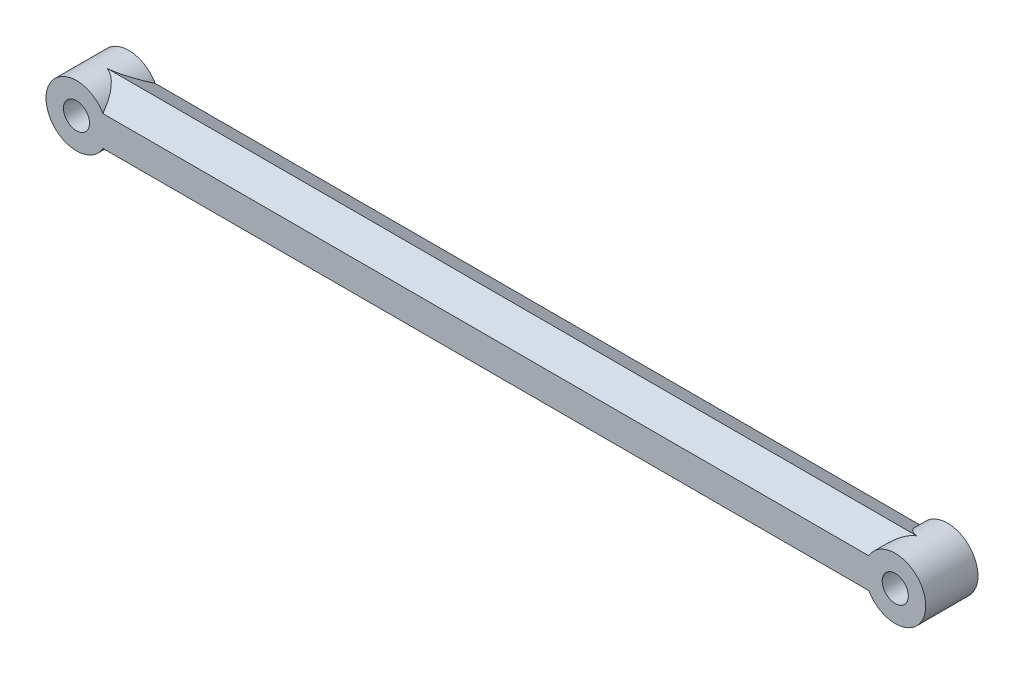
ISO-10303-21;
HEADER;
FILE_DESCRIPTION(('STEP AP214'),'2;1');
FILE_NAME('part.step','',(''),(''),'','','');
FILE_SCHEMA(('AUTOMOTIVE_DESIGN { 1 0 10303 214 1 1 1 1 }'));
ENDSEC;
DATA;
#1=APPLICATION_CONTEXT('core data for automotive mechanical design processes');
#2=APPLICATION_PROTOCOL_DEFINITION('international standard','automotive_design',2000,#1);
#3=PRODUCT_CONTEXT('',#1,'mechanical');
#4=PRODUCT('Part','Part','',(#3));
#5=PRODUCT_RELATED_PRODUCT_CATEGORY('part','',(#4));
#6=PRODUCT_DEFINITION_FORMATION('','',#4);
#7=PRODUCT_DEFINITION_CONTEXT('part definition',#1,'design');
#8=PRODUCT_DEFINITION('design','',#6,#7);
#9=PRODUCT_DEFINITION_SHAPE('','',#8);
#10=(LENGTH_UNIT() NAMED_UNIT(*) SI_UNIT(.MILLI.,.METRE.));
#11=(NAMED_UNIT(*) PLANE_ANGLE_UNIT() SI_UNIT($,.RADIAN.));
#12=(NAMED_UNIT(*) SI_UNIT($,.STERADIAN.) SOLID_ANGLE_UNIT());
#13=UNCERTAINTY_MEASURE_WITH_UNIT(LENGTH_MEASURE(1.E-05),#10,'distance_accuracy_value','');
#14=(GEOMETRIC_REPRESENTATION_CONTEXT(3) GLOBAL_UNCERTAINTY_ASSIGNED_CONTEXT((#13)) GLOBAL_UNIT_ASSIGNED_CONTEXT((#10,
#11,#12)) REPRESENTATION_CONTEXT('',''));
#15=CARTESIAN_POINT('',(0.,0.,0.));
#16=DIRECTION('',(0.,0.,1.));
#17=DIRECTION('',(1.,0.,0.));
#18=AXIS2_PLACEMENT_3D('',#15,#16,#17);
#19=CARTESIAN_POINT('',(-47.,0.,3.));
#20=DIRECTION('',(0.,0.,1.));
#21=DIRECTION('',(1.,0.,0.));
#22=AXIS2_PLACEMENT_3D('',#19,#20,#21);
#23=PLANE('',#22);
#24=CARTESIAN_POINT('',(-47.,0.,3.));
#25=DIRECTION('',(0.,0.,1.));
#26=DIRECTION('',(1.,0.,0.));
#27=AXIS2_PLACEMENT_3D('',#24,#25,#26);
#28=CIRCLE('',#27,3.5);
#29=CARTESIAN_POINT('',(-43.9586187348509,1.73205080756888,3.));
#30=VERTEX_POINT('',#29);
#31=CARTESIAN_POINT('',(-43.9586187348509,-1.73205080756888,3.));
#32=VERTEX_POINT('',#31);
#33=EDGE_CURVE('E11',#30,#32,#28,.T.);
#34=ORIENTED_EDGE('',*,*,#33,.T.);
#35=DIRECTION('',(1.,0.,0.));
#36=VECTOR('',#35,1.);
#37=CARTESIAN_POINT('',(-50.501,-1.73205080756888,3.));
#38=LINE('',#37,#36);
#39=CARTESIAN_POINT('',(43.9586187348509,-1.73205080756888,3.));
#40=VERTEX_POINT('',#39);
#41=EDGE_CURVE('E111',#32,#40,#38,.T.);
#42=ORIENTED_EDGE('',*,*,#41,.T.);
#43=CARTESIAN_POINT('',(47.,0.,3.));
#44=DIRECTION('',(0.,0.,1.));
#45=DIRECTION('',(1.,0.,0.));
#46=AXIS2_PLACEMENT_3D('',#43,#44,#45);
#47=CIRCLE('',#46,3.5);
#48=CARTESIAN_POINT('',(43.9586187348509,1.73205080756888,3.));
#49=VERTEX_POINT('',#48);
#50=EDGE_CURVE('E132',#40,#49,#47,.T.);
#51=ORIENTED_EDGE('',*,*,#50,.T.);
#52=DIRECTION('',(1.,0.,0.));
#53=VECTOR('',#52,1.);
#54=CARTESIAN_POINT('',(-50.501,1.73205080756888,3.));
#55=LINE('',#54,#53);
#56=EDGE_CURVE('E108',#30,#49,#55,.T.);
#57=ORIENTED_EDGE('',*,*,#56,.F.);
#58=EDGE_LOOP('',(#34,#42,#51,#57));
#59=FACE_BOUND('',#58,.T.);
#60=CARTESIAN_POINT('',(-47.,0.,3.));
#61=DIRECTION('',(0.,0.,1.));
#62=DIRECTION('',(1.,0.,0.));
#63=AXIS2_PLACEMENT_3D('',#60,#61,#62);
#64=CIRCLE('',#63,1.5);
#65=CARTESIAN_POINT('',(-45.5,0.,3.));
#66=VERTEX_POINT('',#65);
#67=EDGE_CURVE('E101',#66,#66,#64,.T.);
#68=ORIENTED_EDGE('',*,*,#67,.F.);
#69=EDGE_LOOP('',(#68));
#70=FACE_BOUND('',#69,.T.);
#71=CARTESIAN_POINT('',(47.,0.,3.));
#72=DIRECTION('',(0.,0.,1.));
#73=DIRECTION('',(1.,0.,0.));
#74=AXIS2_PLACEMENT_3D('',#71,#72,#73);
#75=CIRCLE('',#74,1.5);
#76=CARTESIAN_POINT('',(48.5,0.,3.));
#77=VERTEX_POINT('',#76);
#78=EDGE_CURVE('E136',#77,#77,#75,.T.);
#79=ORIENTED_EDGE('',*,*,#78,.F.);
#80=EDGE_LOOP('',(#79));
#81=FACE_BOUND('',#80,.T.);
#82=ADVANCED_FACE('F37',(#59,#70,#81),#23,.T.);
#83=CARTESIAN_POINT('',(-47.,0.,-3.));
#84=DIRECTION('',(0.,0.,1.));
#85=DIRECTION('',(1.,0.,0.));
#86=AXIS2_PLACEMENT_3D('',#83,#84,#85);
#87=PLANE('',#86);
#88=CARTESIAN_POINT('',(-47.,0.,-3.));
#89=DIRECTION('',(0.,0.,1.));
#90=DIRECTION('',(1.,0.,0.));
#91=AXIS2_PLACEMENT_3D('',#88,#89,#90);
#92=CIRCLE('',#91,3.5);
#93=CARTESIAN_POINT('',(-43.9586187348509,1.73205080756888,-3.));
#94=VERTEX_POINT('',#93);
#95=CARTESIAN_POINT('',(-43.9586187348509,-1.73205080756888,-3.));
#96=VERTEX_POINT('',#95);
#97=EDGE_CURVE('E41',#94,#96,#92,.T.);
#98=ORIENTED_EDGE('',*,*,#97,.F.);
#99=DIRECTION('',(1.,0.,0.));
#100=VECTOR('',#99,1.);
#101=CARTESIAN_POINT('',(-50.501,1.73205080756888,-3.));
#102=LINE('',#101,#100);
#103=CARTESIAN_POINT('',(43.9586187348509,1.73205080756888,-3.));
#104=VERTEX_POINT('',#103);
#105=EDGE_CURVE('E90',#94,#104,#102,.T.);
#106=ORIENTED_EDGE('',*,*,#105,.T.);
#107=CARTESIAN_POINT('',(47.,0.,-3.));
#108=DIRECTION('',(0.,0.,1.));
#109=DIRECTION('',(1.,0.,0.));
#110=AXIS2_PLACEMENT_3D('',#107,#108,#109);
#111=CIRCLE('',#110,3.5);
#112=CARTESIAN_POINT('',(43.9586187348509,-1.73205080756888,-3.));
#113=VERTEX_POINT('',#112);
#114=EDGE_CURVE('E86',#113,#104,#111,.T.);
#115=ORIENTED_EDGE('',*,*,#114,.F.);
#116=DIRECTION('',(1.,0.,0.));
#117=VECTOR('',#116,1.);
#118=CARTESIAN_POINT('',(-50.501,-1.73205080756888,-3.));
#119=LINE('',#118,#117);
#120=EDGE_CURVE('E78',#96,#113,#119,.T.);
#121=ORIENTED_EDGE('',*,*,#120,.F.);
#122=EDGE_LOOP('',(#98,#106,#115,#121));
#123=FACE_BOUND('',#122,.T.);
#124=CARTESIAN_POINT('',(-47.,0.,-3.));
#125=DIRECTION('',(0.,0.,1.));
#126=DIRECTION('',(1.,0.,0.));
#127=AXIS2_PLACEMENT_3D('',#124,#125,#126);
#128=CIRCLE('',#127,1.5);
#129=CARTESIAN_POINT('',(-45.5,0.,-3.));
#130=VERTEX_POINT('',#129);
#131=EDGE_CURVE('E103',#130,#130,#128,.T.);
#132=ORIENTED_EDGE('',*,*,#131,.T.);
#133=EDGE_LOOP('',(#132));
#134=FACE_BOUND('',#133,.T.);
#135=CARTESIAN_POINT('',(47.,0.,-3.));
#136=DIRECTION('',(0.,0.,1.));
#137=DIRECTION('',(1.,0.,0.));
#138=AXIS2_PLACEMENT_3D('',#135,#136,#137);
#139=CIRCLE('',#138,1.5);
#140=CARTESIAN_POINT('',(48.5,0.,-3.));
#141=VERTEX_POINT('',#140);
#142=EDGE_CURVE('E139',#141,#141,#139,.T.);
#143=ORIENTED_EDGE('',*,*,#142,.T.);
#144=EDGE_LOOP('',(#143));
#145=FACE_BOUND('',#144,.T.);
#146=ADVANCED_FACE('F80',(#123,#134,#145),#87,.F.);
#147=CARTESIAN_POINT('',(-47.,0.,3.));
#148=DIRECTION('',(0.,0.,-1.));
#149=DIRECTION('',(-1.,0.,0.));
#150=AXIS2_PLACEMENT_3D('',#147,#148,#149);
#151=CYLINDRICAL_SURFACE('',#150,3.5);
#152=CARTESIAN_POINT('',(-47.,0.,-6.));
#153=DIRECTION('',(0.,-0.866025403784439,-0.5));
#154=DIRECTION('',(0.,0.5,-0.866025403784439));
#155=AXIS2_PLACEMENT_3D('',#152,#153,#154);
#156=ELLIPSE('',#155,7.,3.5);
#157=CARTESIAN_POINT('',(-46.5,-3.46410161513775,0.));
#158=VERTEX_POINT('',#157);
#159=EDGE_CURVE('E91',#158,#96,#156,.F.);
#160=ORIENTED_EDGE('',*,*,#159,.F.);
#161=CARTESIAN_POINT('',(-47.,0.,6.));
#162=DIRECTION('',(0.,-0.866025403784439,0.5));
#163=DIRECTION('',(0.,-0.5,-0.866025403784439));
#164=AXIS2_PLACEMENT_3D('',#161,#162,#163);
#165=ELLIPSE('',#164,7.,3.5);
#166=EDGE_CURVE('E114',#32,#158,#165,.F.);
#167=ORIENTED_EDGE('',*,*,#166,.F.);
#168=ORIENTED_EDGE('',*,*,#33,.F.);
#169=CARTESIAN_POINT('',(-47.,0.,6.));
#170=DIRECTION('',(0.,0.866025403784439,0.5));
#171=DIRECTION('',(0.,0.5,-0.866025403784439));
#172=AXIS2_PLACEMENT_3D('',#169,#170,#171);
#173=ELLIPSE('',#172,7.,3.5);
#174=CARTESIAN_POINT('',(-46.5,3.46410161513775,0.));
#175=VERTEX_POINT('',#174);
#176=EDGE_CURVE('E60',#175,#30,#173,.F.);
#177=ORIENTED_EDGE('',*,*,#176,.F.);
#178=CARTESIAN_POINT('',(-47.,0.,-6.));
#179=DIRECTION('',(0.,0.866025403784439,-0.5));
#180=DIRECTION('',(0.,-0.5,-0.866025403784439));
#181=AXIS2_PLACEMENT_3D('',#178,#179,#180);
#182=ELLIPSE('',#181,7.,3.5);
#183=EDGE_CURVE('E52',#94,#175,#182,.F.);
#184=ORIENTED_EDGE('',*,*,#183,.F.);
#185=ORIENTED_EDGE('',*,*,#97,.T.);
#186=EDGE_LOOP('',(#160,#167,#168,#177,#184,#185));
#187=FACE_BOUND('',#186,.T.);
#188=ADVANCED_FACE('F39',(#187),#151,.T.);
#189=CARTESIAN_POINT('',(-47.,0.,3.));
#190=DIRECTION('',(0.,0.,-1.));
#191=DIRECTION('',(-1.,0.,0.));
#192=AXIS2_PLACEMENT_3D('',#189,#190,#191);
#193=CYLINDRICAL_SURFACE('',#192,1.5);
#194=ORIENTED_EDGE('',*,*,#67,.T.);
#195=EDGE_LOOP('',(#194));
#196=FACE_BOUND('',#195,.T.);
#197=ORIENTED_EDGE('',*,*,#131,.F.);
#198=EDGE_LOOP('',(#197));
#199=FACE_BOUND('',#198,.T.);
#200=ADVANCED_FACE('F156',(#196,#199),#193,.F.);
#201=CARTESIAN_POINT('',(-50.501,-1.73205080756888,3.));
#202=DIRECTION('',(0.,-0.866025403784439,0.5));
#203=DIRECTION('',(0.,-0.5,-0.866025403784439));
#204=AXIS2_PLACEMENT_3D('',#201,#202,#203);
#205=PLANE('',#204);
#206=ORIENTED_EDGE('',*,*,#41,.F.);
#207=ORIENTED_EDGE('',*,*,#166,.T.);
#208=DIRECTION('',(1.,0.,0.));
#209=VECTOR('',#208,1.);
#210=CARTESIAN_POINT('',(-50.501,-3.46410161513775,0.));
#211=LINE('',#210,#209);
#212=CARTESIAN_POINT('',(46.5000000000001,-3.46410161513775,0.));
#213=VERTEX_POINT('',#212);
#214=EDGE_CURVE('E96',#158,#213,#211,.T.);
#215=ORIENTED_EDGE('',*,*,#214,.T.);
#216=CARTESIAN_POINT('',(47.,0.,6.00000000000003));
#217=DIRECTION('',(0.,0.866025403784439,-0.5));
#218=DIRECTION('',(0.,-0.5,-0.866025403784439));
#219=AXIS2_PLACEMENT_3D('',#216,#217,#218);
#220=ELLIPSE('',#219,7.,3.5);
#221=EDGE_CURVE('E129',#40,#213,#220,.F.);
#222=ORIENTED_EDGE('',*,*,#221,.F.);
#223=EDGE_LOOP('',(#206,#207,#215,#222));
#224=FACE_BOUND('',#223,.T.);
#225=ADVANCED_FACE('F159',(#224),#205,.T.);
#226=CARTESIAN_POINT('',(-50.501,-3.46410161513775,0.));
#227=DIRECTION('',(0.,-0.866025403784439,-0.5));
#228=DIRECTION('',(0.,0.5,-0.866025403784439));
#229=AXIS2_PLACEMENT_3D('',#226,#227,#228);
#230=PLANE('',#229);
#231=ORIENTED_EDGE('',*,*,#214,.F.);
#232=ORIENTED_EDGE('',*,*,#159,.T.);
#233=ORIENTED_EDGE('',*,*,#120,.T.);
#234=CARTESIAN_POINT('',(47.,0.,-6.00000000000003));
#235=DIRECTION('',(0.,0.866025403784439,0.5));
#236=DIRECTION('',(0.,0.5,-0.866025403784439));
#237=AXIS2_PLACEMENT_3D('',#234,#235,#236);
#238=ELLIPSE('',#237,7.,3.5);
#239=EDGE_CURVE('E127',#213,#113,#238,.F.);
#240=ORIENTED_EDGE('',*,*,#239,.F.);
#241=EDGE_LOOP('',(#231,#232,#233,#240));
#242=FACE_BOUND('',#241,.T.);
#243=ADVANCED_FACE('F94',(#242),#230,.T.);
#244=CARTESIAN_POINT('',(-50.501,1.73205080756888,-3.));
#245=DIRECTION('',(0.,0.866025403784439,-0.5));
#246=DIRECTION('',(0.,0.5,0.866025403784439));
#247=AXIS2_PLACEMENT_3D('',#244,#245,#246);
#248=PLANE('',#247);
#249=ORIENTED_EDGE('',*,*,#105,.F.);
#250=ORIENTED_EDGE('',*,*,#183,.T.);
#251=DIRECTION('',(1.,0.,0.));
#252=VECTOR('',#251,1.);
#253=CARTESIAN_POINT('',(-50.501,3.46410161513775,0.));
#254=LINE('',#253,#252);
#255=CARTESIAN_POINT('',(46.4999999999999,3.46410161513775,0.));
#256=VERTEX_POINT('',#255);
#257=EDGE_CURVE('E120',#175,#256,#254,.T.);
#258=ORIENTED_EDGE('',*,*,#257,.T.);
#259=CARTESIAN_POINT('',(47.,0.,-5.99999999999997));
#260=DIRECTION('',(0.,-0.866025403784439,0.5));
#261=DIRECTION('',(0.,-0.5,-0.866025403784439));
#262=AXIS2_PLACEMENT_3D('',#259,#260,#261);
#263=ELLIPSE('',#262,7.,3.5);
#264=EDGE_CURVE('E124',#104,#256,#263,.F.);
#265=ORIENTED_EDGE('',*,*,#264,.F.);
#266=EDGE_LOOP('',(#249,#250,#258,#265));
#267=FACE_BOUND('',#266,.T.);
#268=ADVANCED_FACE('F162',(#267),#248,.T.);
#269=CARTESIAN_POINT('',(-50.501,3.46410161513775,0.));
#270=DIRECTION('',(0.,0.866025403784439,0.5));
#271=DIRECTION('',(0.,-0.5,0.866025403784439));
#272=AXIS2_PLACEMENT_3D('',#269,#270,#271);
#273=PLANE('',#272);
#274=ORIENTED_EDGE('',*,*,#257,.F.);
#275=ORIENTED_EDGE('',*,*,#176,.T.);
#276=ORIENTED_EDGE('',*,*,#56,.T.);
#277=CARTESIAN_POINT('',(47.,0.,5.99999999999997));
#278=DIRECTION('',(0.,-0.866025403784439,-0.5));
#279=DIRECTION('',(0.,0.5,-0.866025403784439));
#280=AXIS2_PLACEMENT_3D('',#277,#278,#279);
#281=ELLIPSE('',#280,7.,3.5);
#282=EDGE_CURVE('E115',#256,#49,#281,.F.);
#283=ORIENTED_EDGE('',*,*,#282,.F.);
#284=EDGE_LOOP('',(#274,#275,#276,#283));
#285=FACE_BOUND('',#284,.T.);
#286=ADVANCED_FACE('F166',(#285),#273,.T.);
#287=CARTESIAN_POINT('',(47.,0.,3.));
#288=DIRECTION('',(0.,0.,-1.));
#289=DIRECTION('',(-1.,0.,0.));
#290=AXIS2_PLACEMENT_3D('',#287,#288,#289);
#291=CYLINDRICAL_SURFACE('',#290,3.5);
#292=ORIENTED_EDGE('',*,*,#221,.T.);
#293=ORIENTED_EDGE('',*,*,#239,.T.);
#294=ORIENTED_EDGE('',*,*,#114,.T.);
#295=ORIENTED_EDGE('',*,*,#264,.T.);
#296=ORIENTED_EDGE('',*,*,#282,.T.);
#297=ORIENTED_EDGE('',*,*,#50,.F.);
#298=EDGE_LOOP('',(#292,#293,#294,#295,#296,#297));
#299=FACE_BOUND('',#298,.T.);
#300=ADVANCED_FACE('F169',(#299),#291,.T.);
#301=CARTESIAN_POINT('',(47.,0.,3.));
#302=DIRECTION('',(0.,0.,-1.));
#303=DIRECTION('',(-1.,0.,0.));
#304=AXIS2_PLACEMENT_3D('',#301,#302,#303);
#305=CYLINDRICAL_SURFACE('',#304,1.5);
#306=ORIENTED_EDGE('',*,*,#78,.T.);
#307=EDGE_LOOP('',(#306));
#308=FACE_BOUND('',#307,.T.);
#309=ORIENTED_EDGE('',*,*,#142,.F.);
#310=EDGE_LOOP('',(#309));
#311=FACE_BOUND('',#310,.T.);
#312=ADVANCED_FACE('F145',(#308,#311),#305,.F.);
#313=CLOSED_SHELL('',(#82,#146,#188,#200,#225,#243,#268,#286,#300,#312));
#314=MANIFOLD_SOLID_BREP('B2',#313);
#315=ADVANCED_BREP_SHAPE_REPRESENTATION('',(#18,#314),#14);
#316=SHAPE_DEFINITION_REPRESENTATION(#9,#315);
ENDSEC;
END-ISO-10303-21;
